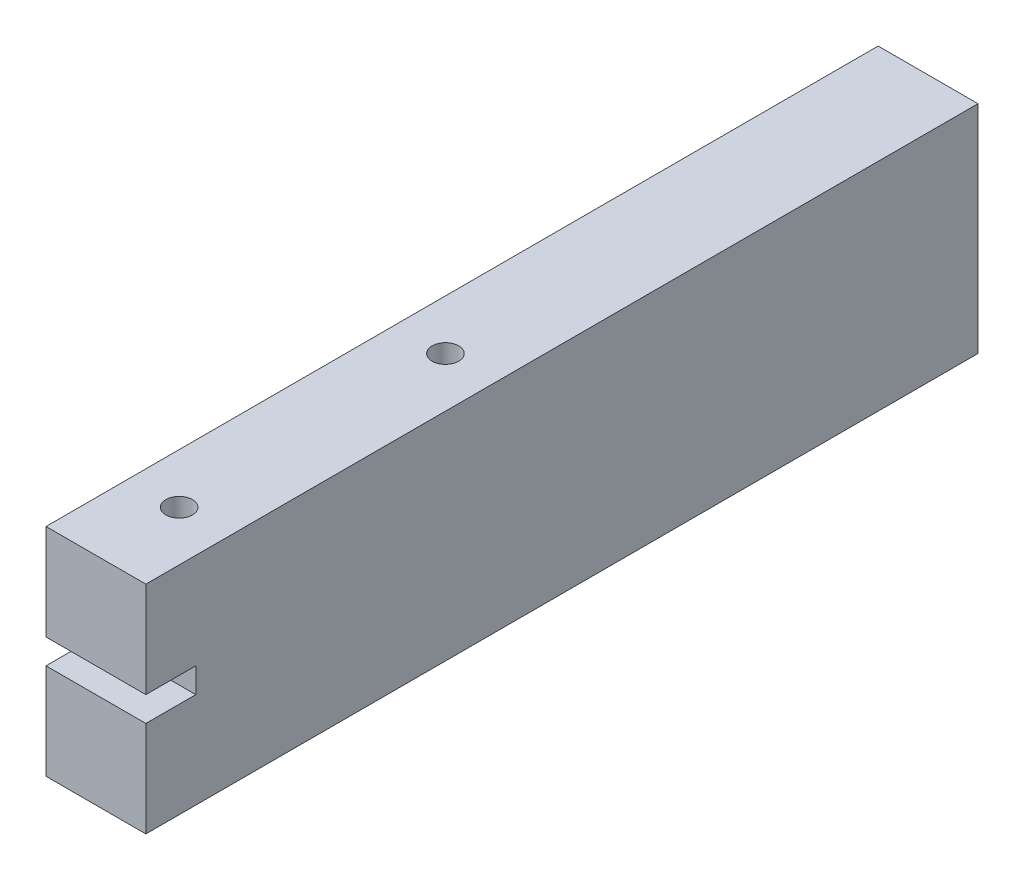
ISO-10303-21;
HEADER;
FILE_DESCRIPTION(('STEP AP214'),'2;1');
FILE_NAME('part.step','',(''),(''),'','','');
FILE_SCHEMA(('AUTOMOTIVE_DESIGN { 1 0 10303 214 1 1 1 1 }'));
ENDSEC;
DATA;
#1=APPLICATION_CONTEXT('core data for automotive mechanical design processes');
#2=APPLICATION_PROTOCOL_DEFINITION('international standard','automotive_design',2000,#1);
#3=PRODUCT_CONTEXT('',#1,'mechanical');
#4=PRODUCT('Part','Part','',(#3));
#5=PRODUCT_RELATED_PRODUCT_CATEGORY('part','',(#4));
#6=PRODUCT_DEFINITION_FORMATION('','',#4);
#7=PRODUCT_DEFINITION_CONTEXT('part definition',#1,'design');
#8=PRODUCT_DEFINITION('design','',#6,#7);
#9=PRODUCT_DEFINITION_SHAPE('','',#8);
#10=(LENGTH_UNIT() NAMED_UNIT(*) SI_UNIT(.MILLI.,.METRE.));
#11=(NAMED_UNIT(*) PLANE_ANGLE_UNIT() SI_UNIT($,.RADIAN.));
#12=(NAMED_UNIT(*) SI_UNIT($,.STERADIAN.) SOLID_ANGLE_UNIT());
#13=UNCERTAINTY_MEASURE_WITH_UNIT(LENGTH_MEASURE(1.E-05),#10,'distance_accuracy_value','');
#14=(GEOMETRIC_REPRESENTATION_CONTEXT(3) GLOBAL_UNCERTAINTY_ASSIGNED_CONTEXT((#13)) GLOBAL_UNIT_ASSIGNED_CONTEXT((#10,
#11,#12)) REPRESENTATION_CONTEXT('',''));
#15=CARTESIAN_POINT('',(0.,0.,0.));
#16=DIRECTION('',(0.,0.,1.));
#17=DIRECTION('',(1.,0.,0.));
#18=AXIS2_PLACEMENT_3D('',#15,#16,#17);
#19=CARTESIAN_POINT('',(-6.,13.,0.));
#20=DIRECTION('',(1.,0.,0.));
#21=DIRECTION('',(0.,0.,-1.));
#22=AXIS2_PLACEMENT_3D('',#19,#20,#21);
#23=PLANE('',#22);
#24=DIRECTION('',(0.,0.,1.));
#25=VECTOR('',#24,1.);
#26=CARTESIAN_POINT('',(-6.,-1.5,0.));
#27=LINE('',#26,#25);
#28=CARTESIAN_POINT('',(-6.,-1.5,-6.));
#29=VERTEX_POINT('',#28);
#30=CARTESIAN_POINT('',(-6.,-1.5,0.));
#31=VERTEX_POINT('',#30);
#32=EDGE_CURVE('E113',#29,#31,#27,.T.);
#33=ORIENTED_EDGE('',*,*,#32,.F.);
#34=DIRECTION('',(0.,1.,0.));
#35=VECTOR('',#34,1.);
#36=CARTESIAN_POINT('',(-6.,-1.5,-6.));
#37=LINE('',#36,#35);
#38=CARTESIAN_POINT('',(-6.,1.5,-6.));
#39=VERTEX_POINT('',#38);
#40=EDGE_CURVE('E104',#29,#39,#37,.T.);
#41=ORIENTED_EDGE('',*,*,#40,.T.);
#42=DIRECTION('',(0.,0.,1.));
#43=VECTOR('',#42,1.);
#44=CARTESIAN_POINT('',(-6.,1.5,0.));
#45=LINE('',#44,#43);
#46=CARTESIAN_POINT('',(-6.,1.5,0.));
#47=VERTEX_POINT('',#46);
#48=EDGE_CURVE('E94',#39,#47,#45,.T.);
#49=ORIENTED_EDGE('',*,*,#48,.T.);
#50=DIRECTION('',(0.,-1.,0.));
#51=VECTOR('',#50,1.);
#52=CARTESIAN_POINT('',(-6.,13.,0.));
#53=LINE('',#52,#51);
#54=CARTESIAN_POINT('',(-6.,13.,0.));
#55=VERTEX_POINT('',#54);
#56=EDGE_CURVE('E11',#55,#47,#53,.T.);
#57=ORIENTED_EDGE('',*,*,#56,.F.);
#58=DIRECTION('',(0.,0.,1.));
#59=VECTOR('',#58,1.);
#60=CARTESIAN_POINT('',(-6.,13.,0.));
#61=LINE('',#60,#59);
#62=CARTESIAN_POINT('',(-6.,13.,-100.));
#63=VERTEX_POINT('',#62);
#64=EDGE_CURVE('E142',#63,#55,#61,.T.);
#65=ORIENTED_EDGE('',*,*,#64,.F.);
#66=DIRECTION('',(0.,-1.,0.));
#67=VECTOR('',#66,1.);
#68=CARTESIAN_POINT('',(-6.,13.,-100.));
#69=LINE('',#68,#67);
#70=CARTESIAN_POINT('',(-6.,-13.,-100.));
#71=VERTEX_POINT('',#70);
#72=EDGE_CURVE('E149',#63,#71,#69,.T.);
#73=ORIENTED_EDGE('',*,*,#72,.T.);
#74=DIRECTION('',(0.,0.,1.));
#75=VECTOR('',#74,1.);
#76=CARTESIAN_POINT('',(-6.,-13.,0.));
#77=LINE('',#76,#75);
#78=CARTESIAN_POINT('',(-6.,-13.,0.));
#79=VERTEX_POINT('',#78);
#80=EDGE_CURVE('E132',#71,#79,#77,.T.);
#81=ORIENTED_EDGE('',*,*,#80,.T.);
#82=EDGE_CURVE('E38',#31,#79,#53,.T.);
#83=ORIENTED_EDGE('',*,*,#82,.F.);
#84=EDGE_LOOP('',(#33,#41,#49,#57,#65,#73,#81,#83));
#85=FACE_BOUND('',#84,.T.);
#86=ADVANCED_FACE('F31',(#85),#23,.F.);
#87=CARTESIAN_POINT('',(-6.,13.,0.));
#88=DIRECTION('',(0.,0.,-1.));
#89=DIRECTION('',(-1.,0.,0.));
#90=AXIS2_PLACEMENT_3D('',#87,#88,#89);
#91=PLANE('',#90);
#92=DIRECTION('',(1.,0.,0.));
#93=VECTOR('',#92,1.);
#94=CARTESIAN_POINT('',(6.,-1.5,0.));
#95=LINE('',#94,#93);
#96=CARTESIAN_POINT('',(6.,-1.5,0.));
#97=VERTEX_POINT('',#96);
#98=EDGE_CURVE('E119',#31,#97,#95,.T.);
#99=ORIENTED_EDGE('',*,*,#98,.F.);
#100=ORIENTED_EDGE('',*,*,#82,.T.);
#101=DIRECTION('',(1.,0.,0.));
#102=VECTOR('',#101,1.);
#103=CARTESIAN_POINT('',(-6.,-13.,0.));
#104=LINE('',#103,#102);
#105=CARTESIAN_POINT('',(6.,-13.,0.));
#106=VERTEX_POINT('',#105);
#107=EDGE_CURVE('E135',#79,#106,#104,.T.);
#108=ORIENTED_EDGE('',*,*,#107,.T.);
#109=DIRECTION('',(0.,-1.,0.));
#110=VECTOR('',#109,1.);
#111=CARTESIAN_POINT('',(6.,13.,0.));
#112=LINE('',#111,#110);
#113=EDGE_CURVE('E154',#97,#106,#112,.T.);
#114=ORIENTED_EDGE('',*,*,#113,.F.);
#115=EDGE_LOOP('',(#99,#100,#108,#114));
#116=FACE_BOUND('',#115,.T.);
#117=ADVANCED_FACE('F170',(#116),#91,.F.);
#118=CARTESIAN_POINT('',(6.,13.,0.));
#119=DIRECTION('',(-1.,0.,0.));
#120=DIRECTION('',(0.,0.,1.));
#121=AXIS2_PLACEMENT_3D('',#118,#119,#120);
#122=PLANE('',#121);
#123=DIRECTION('',(0.,0.,-1.));
#124=VECTOR('',#123,1.);
#125=CARTESIAN_POINT('',(6.,-1.5,0.));
#126=LINE('',#125,#124);
#127=CARTESIAN_POINT('',(6.,-1.5,-6.));
#128=VERTEX_POINT('',#127);
#129=EDGE_CURVE('E166',#97,#128,#126,.T.);
#130=ORIENTED_EDGE('',*,*,#129,.F.);
#131=ORIENTED_EDGE('',*,*,#113,.T.);
#132=DIRECTION('',(0.,0.,-1.));
#133=VECTOR('',#132,1.);
#134=CARTESIAN_POINT('',(6.,-13.,0.));
#135=LINE('',#134,#133);
#136=CARTESIAN_POINT('',(6.,-13.,-100.));
#137=VERTEX_POINT('',#136);
#138=EDGE_CURVE('E138',#106,#137,#135,.T.);
#139=ORIENTED_EDGE('',*,*,#138,.T.);
#140=DIRECTION('',(0.,-1.,0.));
#141=VECTOR('',#140,1.);
#142=CARTESIAN_POINT('',(6.,13.,-100.));
#143=LINE('',#142,#141);
#144=CARTESIAN_POINT('',(6.,13.,-100.));
#145=VERTEX_POINT('',#144);
#146=EDGE_CURVE('E152',#145,#137,#143,.T.);
#147=ORIENTED_EDGE('',*,*,#146,.F.);
#148=DIRECTION('',(0.,0.,-1.));
#149=VECTOR('',#148,1.);
#150=CARTESIAN_POINT('',(6.,13.,0.));
#151=LINE('',#150,#149);
#152=CARTESIAN_POINT('',(6.,13.,0.));
#153=VERTEX_POINT('',#152);
#154=EDGE_CURVE('E146',#153,#145,#151,.T.);
#155=ORIENTED_EDGE('',*,*,#154,.F.);
#156=CARTESIAN_POINT('',(6.,1.5,0.));
#157=VERTEX_POINT('',#156);
#158=EDGE_CURVE('E155',#153,#157,#112,.T.);
#159=ORIENTED_EDGE('',*,*,#158,.T.);
#160=DIRECTION('',(0.,0.,-1.));
#161=VECTOR('',#160,1.);
#162=CARTESIAN_POINT('',(6.,1.5,0.));
#163=LINE('',#162,#161);
#164=CARTESIAN_POINT('',(6.,1.5,-6.));
#165=VERTEX_POINT('',#164);
#166=EDGE_CURVE('E109',#157,#165,#163,.T.);
#167=ORIENTED_EDGE('',*,*,#166,.T.);
#168=DIRECTION('',(0.,1.,0.));
#169=VECTOR('',#168,1.);
#170=CARTESIAN_POINT('',(6.,-1.5,-6.));
#171=LINE('',#170,#169);
#172=EDGE_CURVE('E107',#128,#165,#171,.T.);
#173=ORIENTED_EDGE('',*,*,#172,.F.);
#174=EDGE_LOOP('',(#130,#131,#139,#147,#155,#159,#167,#173));
#175=FACE_BOUND('',#174,.T.);
#176=ADVANCED_FACE('F162',(#175),#122,.F.);
#177=CARTESIAN_POINT('',(-6.,13.,-100.));
#178=DIRECTION('',(0.,-1.,0.));
#179=DIRECTION('',(0.,0.,-1.));
#180=AXIS2_PLACEMENT_3D('',#177,#178,#179);
#181=PLANE('',#180);
#182=CARTESIAN_POINT('',(0.,13.,-10.));
#183=DIRECTION('',(0.,1.,0.));
#184=DIRECTION('',(0.,0.,1.));
#185=AXIS2_PLACEMENT_3D('',#182,#183,#184);
#186=CIRCLE('',#185,1.6);
#187=CARTESIAN_POINT('',(0.,13.,-8.4));
#188=VERTEX_POINT('',#187);
#189=EDGE_CURVE('E129',#188,#188,#186,.T.);
#190=ORIENTED_EDGE('',*,*,#189,.F.);
#191=EDGE_LOOP('',(#190));
#192=FACE_BOUND('',#191,.T.);
#193=ORIENTED_EDGE('',*,*,#64,.T.);
#194=DIRECTION('',(1.,0.,0.));
#195=VECTOR('',#194,1.);
#196=CARTESIAN_POINT('',(-6.,13.,0.));
#197=LINE('',#196,#195);
#198=EDGE_CURVE('E144',#55,#153,#197,.T.);
#199=ORIENTED_EDGE('',*,*,#198,.T.);
#200=ORIENTED_EDGE('',*,*,#154,.T.);
#201=DIRECTION('',(-1.,0.,0.));
#202=VECTOR('',#201,1.);
#203=CARTESIAN_POINT('',(-6.,13.,-100.));
#204=LINE('',#203,#202);
#205=EDGE_CURVE('E53',#145,#63,#204,.T.);
#206=ORIENTED_EDGE('',*,*,#205,.T.);
#207=EDGE_LOOP('',(#193,#199,#200,#206));
#208=FACE_BOUND('',#207,.T.);
#209=CARTESIAN_POINT('',(0.,13.,-42.));
#210=DIRECTION('',(0.,1.,0.));
#211=DIRECTION('',(0.,0.,1.));
#212=AXIS2_PLACEMENT_3D('',#209,#210,#211);
#213=CIRCLE('',#212,1.6);
#214=CARTESIAN_POINT('',(0.,13.,-40.4));
#215=VERTEX_POINT('',#214);
#216=EDGE_CURVE('E117',#215,#215,#213,.T.);
#217=ORIENTED_EDGE('',*,*,#216,.F.);
#218=EDGE_LOOP('',(#217));
#219=FACE_BOUND('',#218,.T.);
#220=ADVANCED_FACE('F179',(#192,#208,#219),#181,.F.);
#221=CARTESIAN_POINT('',(-6.,-13.,-100.));
#222=DIRECTION('',(0.,-1.,0.));
#223=DIRECTION('',(0.,0.,-1.));
#224=AXIS2_PLACEMENT_3D('',#221,#222,#223);
#225=PLANE('',#224);
#226=CARTESIAN_POINT('',(0.,-13.,-10.));
#227=DIRECTION('',(0.,1.,0.));
#228=DIRECTION('',(0.,0.,1.));
#229=AXIS2_PLACEMENT_3D('',#226,#227,#228);
#230=CIRCLE('',#229,1.6);
#231=CARTESIAN_POINT('',(0.,-13.,-8.4));
#232=VERTEX_POINT('',#231);
#233=EDGE_CURVE('E126',#232,#232,#230,.T.);
#234=ORIENTED_EDGE('',*,*,#233,.T.);
#235=EDGE_LOOP('',(#234));
#236=FACE_BOUND('',#235,.T.);
#237=ORIENTED_EDGE('',*,*,#80,.F.);
#238=DIRECTION('',(-1.,0.,0.));
#239=VECTOR('',#238,1.);
#240=CARTESIAN_POINT('',(-6.,-13.,-100.));
#241=LINE('',#240,#239);
#242=EDGE_CURVE('E140',#137,#71,#241,.T.);
#243=ORIENTED_EDGE('',*,*,#242,.F.);
#244=ORIENTED_EDGE('',*,*,#138,.F.);
#245=ORIENTED_EDGE('',*,*,#107,.F.);
#246=EDGE_LOOP('',(#237,#243,#244,#245));
#247=FACE_BOUND('',#246,.T.);
#248=CARTESIAN_POINT('',(0.,-13.,-42.));
#249=DIRECTION('',(0.,1.,0.));
#250=DIRECTION('',(0.,0.,1.));
#251=AXIS2_PLACEMENT_3D('',#248,#249,#250);
#252=CIRCLE('',#251,1.6);
#253=CARTESIAN_POINT('',(0.,-13.,-40.4));
#254=VERTEX_POINT('',#253);
#255=EDGE_CURVE('E114',#254,#254,#252,.T.);
#256=ORIENTED_EDGE('',*,*,#255,.T.);
#257=EDGE_LOOP('',(#256));
#258=FACE_BOUND('',#257,.T.);
#259=ADVANCED_FACE('F174',(#236,#247,#258),#225,.T.);
#260=ORIENTED_EDGE('',*,*,#56,.T.);
#261=DIRECTION('',(1.,0.,0.));
#262=VECTOR('',#261,1.);
#263=CARTESIAN_POINT('',(6.,1.5,0.));
#264=LINE('',#263,#262);
#265=EDGE_CURVE('E97',#47,#157,#264,.T.);
#266=ORIENTED_EDGE('',*,*,#265,.T.);
#267=ORIENTED_EDGE('',*,*,#158,.F.);
#268=ORIENTED_EDGE('',*,*,#198,.F.);
#269=EDGE_LOOP('',(#260,#266,#267,#268));
#270=FACE_BOUND('',#269,.T.);
#271=ADVANCED_FACE('F182',(#270),#91,.F.);
#272=CARTESIAN_POINT('',(-6.,13.,-100.));
#273=DIRECTION('',(0.,0.,1.));
#274=DIRECTION('',(1.,0.,0.));
#275=AXIS2_PLACEMENT_3D('',#272,#273,#274);
#276=PLANE('',#275);
#277=ORIENTED_EDGE('',*,*,#242,.T.);
#278=ORIENTED_EDGE('',*,*,#72,.F.);
#279=ORIENTED_EDGE('',*,*,#205,.F.);
#280=ORIENTED_EDGE('',*,*,#146,.T.);
#281=EDGE_LOOP('',(#277,#278,#279,#280));
#282=FACE_BOUND('',#281,.T.);
#283=ADVANCED_FACE('F177',(#282),#276,.F.);
#284=CARTESIAN_POINT('',(0.,13.,-10.));
#285=DIRECTION('',(0.,-1.,0.));
#286=DIRECTION('',(0.,0.,-1.));
#287=AXIS2_PLACEMENT_3D('',#284,#285,#286);
#288=CYLINDRICAL_SURFACE('',#287,1.6);
#289=ORIENTED_EDGE('',*,*,#189,.T.);
#290=EDGE_LOOP('',(#289));
#291=FACE_BOUND('',#290,.T.);
#292=ORIENTED_EDGE('',*,*,#233,.F.);
#293=EDGE_LOOP('',(#292));
#294=FACE_BOUND('',#293,.T.);
#295=ADVANCED_FACE('F212',(#291,#294),#288,.F.);
#296=CARTESIAN_POINT('',(0.,13.,-42.));
#297=DIRECTION('',(0.,-1.,0.));
#298=DIRECTION('',(0.,0.,-1.));
#299=AXIS2_PLACEMENT_3D('',#296,#297,#298);
#300=CYLINDRICAL_SURFACE('',#299,1.6);
#301=ORIENTED_EDGE('',*,*,#216,.T.);
#302=EDGE_LOOP('',(#301));
#303=FACE_BOUND('',#302,.T.);
#304=ORIENTED_EDGE('',*,*,#255,.F.);
#305=EDGE_LOOP('',(#304));
#306=FACE_BOUND('',#305,.T.);
#307=ADVANCED_FACE('F197',(#303,#306),#300,.F.);
#308=CARTESIAN_POINT('',(6.,-1.5,-6.));
#309=DIRECTION('',(0.,0.,-1.));
#310=DIRECTION('',(-1.,0.,0.));
#311=AXIS2_PLACEMENT_3D('',#308,#309,#310);
#312=PLANE('',#311);
#313=DIRECTION('',(-1.,0.,0.));
#314=VECTOR('',#313,1.);
#315=CARTESIAN_POINT('',(6.,1.5,-6.));
#316=LINE('',#315,#314);
#317=EDGE_CURVE('E45',#165,#39,#316,.T.);
#318=ORIENTED_EDGE('',*,*,#317,.T.);
#319=ORIENTED_EDGE('',*,*,#40,.F.);
#320=DIRECTION('',(-1.,0.,0.));
#321=VECTOR('',#320,1.);
#322=CARTESIAN_POINT('',(6.,-1.5,-6.));
#323=LINE('',#322,#321);
#324=EDGE_CURVE('E184',#128,#29,#323,.T.);
#325=ORIENTED_EDGE('',*,*,#324,.F.);
#326=ORIENTED_EDGE('',*,*,#172,.T.);
#327=EDGE_LOOP('',(#318,#319,#325,#326));
#328=FACE_BOUND('',#327,.T.);
#329=ADVANCED_FACE('F103',(#328),#312,.F.);
#330=CARTESIAN_POINT('',(6.,-1.5,-6.));
#331=DIRECTION('',(0.,1.,0.));
#332=DIRECTION('',(0.,0.,1.));
#333=AXIS2_PLACEMENT_3D('',#330,#331,#332);
#334=PLANE('',#333);
#335=ORIENTED_EDGE('',*,*,#129,.T.);
#336=ORIENTED_EDGE('',*,*,#324,.T.);
#337=ORIENTED_EDGE('',*,*,#32,.T.);
#338=ORIENTED_EDGE('',*,*,#98,.T.);
#339=EDGE_LOOP('',(#335,#336,#337,#338));
#340=FACE_BOUND('',#339,.T.);
#341=ADVANCED_FACE('F188',(#340),#334,.T.);
#342=CARTESIAN_POINT('',(6.,1.5,-6.));
#343=DIRECTION('',(0.,1.,0.));
#344=DIRECTION('',(0.,0.,1.));
#345=AXIS2_PLACEMENT_3D('',#342,#343,#344);
#346=PLANE('',#345);
#347=ORIENTED_EDGE('',*,*,#166,.F.);
#348=ORIENTED_EDGE('',*,*,#265,.F.);
#349=ORIENTED_EDGE('',*,*,#48,.F.);
#350=ORIENTED_EDGE('',*,*,#317,.F.);
#351=EDGE_LOOP('',(#347,#348,#349,#350));
#352=FACE_BOUND('',#351,.T.);
#353=ADVANCED_FACE('F95',(#352),#346,.F.);
#354=CLOSED_SHELL('',(#86,#117,#176,#220,#259,#271,#283,#295,#307,#329,#341,#353));
#355=MANIFOLD_SOLID_BREP('B2',#354);
#356=ADVANCED_BREP_SHAPE_REPRESENTATION('',(#18,#355),#14);
#357=SHAPE_DEFINITION_REPRESENTATION(#9,#356);
ENDSEC;
END-ISO-10303-21;
